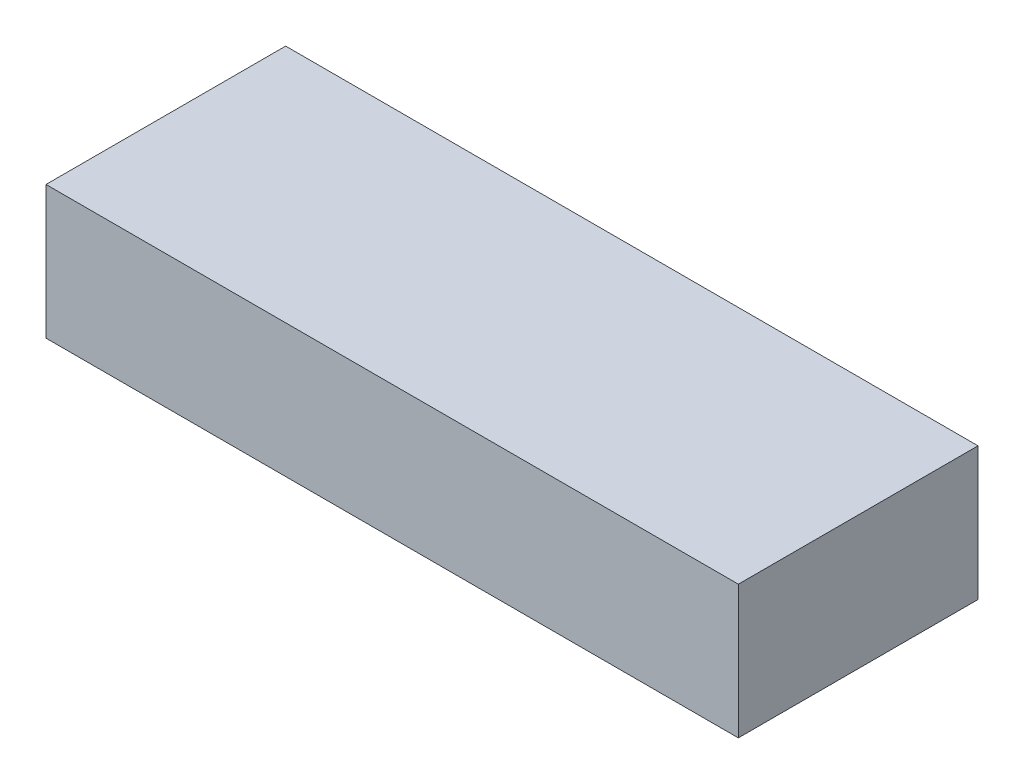
ISO-10303-21;
HEADER;
FILE_DESCRIPTION(('STEP AP214'),'2;1');
FILE_NAME('part.step','',(''),(''),'','','');
FILE_SCHEMA(('AUTOMOTIVE_DESIGN { 1 0 10303 214 1 1 1 1 }'));
ENDSEC;
DATA;
#1=APPLICATION_CONTEXT('core data for automotive mechanical design processes');
#2=APPLICATION_PROTOCOL_DEFINITION('international standard','automotive_design',2000,#1);
#3=PRODUCT_CONTEXT('',#1,'mechanical');
#4=PRODUCT('Part','Part','',(#3));
#5=PRODUCT_RELATED_PRODUCT_CATEGORY('part','',(#4));
#6=PRODUCT_DEFINITION_FORMATION('','',#4);
#7=PRODUCT_DEFINITION_CONTEXT('part definition',#1,'design');
#8=PRODUCT_DEFINITION('design','',#6,#7);
#9=PRODUCT_DEFINITION_SHAPE('','',#8);
#10=(LENGTH_UNIT() NAMED_UNIT(*) SI_UNIT(.MILLI.,.METRE.));
#11=(NAMED_UNIT(*) PLANE_ANGLE_UNIT() SI_UNIT($,.RADIAN.));
#12=(NAMED_UNIT(*) SI_UNIT($,.STERADIAN.) SOLID_ANGLE_UNIT());
#13=UNCERTAINTY_MEASURE_WITH_UNIT(LENGTH_MEASURE(1.E-05),#10,'distance_accuracy_value','');
#14=(GEOMETRIC_REPRESENTATION_CONTEXT(3) GLOBAL_UNCERTAINTY_ASSIGNED_CONTEXT((#13)) GLOBAL_UNIT_ASSIGNED_CONTEXT((#10,
#11,#12)) REPRESENTATION_CONTEXT('',''));
#15=CARTESIAN_POINT('',(0.,0.,0.));
#16=DIRECTION('',(0.,0.,1.));
#17=DIRECTION('',(1.,0.,0.));
#18=AXIS2_PLACEMENT_3D('',#15,#16,#17);
#19=CARTESIAN_POINT('',(-13.,-2.5,9.));
#20=DIRECTION('',(1.,0.,0.));
#21=DIRECTION('',(0.,0.,-1.));
#22=AXIS2_PLACEMENT_3D('',#19,#20,#21);
#23=PLANE('',#22);
#24=DIRECTION('',(0.,-1.,0.));
#25=VECTOR('',#24,1.);
#26=CARTESIAN_POINT('',(-13.,-2.5,0.));
#27=LINE('',#26,#25);
#28=CARTESIAN_POINT('',(-13.,2.5,0.));
#29=VERTEX_POINT('',#28);
#30=CARTESIAN_POINT('',(-13.,-2.5,0.));
#31=VERTEX_POINT('',#30);
#32=EDGE_CURVE('E101',#29,#31,#27,.T.);
#33=ORIENTED_EDGE('',*,*,#32,.T.);
#34=DIRECTION('',(0.,0.,-1.));
#35=VECTOR('',#34,1.);
#36=CARTESIAN_POINT('',(-13.,-2.5,9.));
#37=LINE('',#36,#35);
#38=CARTESIAN_POINT('',(-13.,-2.5,9.));
#39=VERTEX_POINT('',#38);
#40=EDGE_CURVE('E11',#39,#31,#37,.T.);
#41=ORIENTED_EDGE('',*,*,#40,.F.);
#42=DIRECTION('',(0.,-1.,0.));
#43=VECTOR('',#42,1.);
#44=CARTESIAN_POINT('',(-13.,-2.5,9.));
#45=LINE('',#44,#43);
#46=CARTESIAN_POINT('',(-13.,2.5,9.));
#47=VERTEX_POINT('',#46);
#48=EDGE_CURVE('E85',#47,#39,#45,.T.);
#49=ORIENTED_EDGE('',*,*,#48,.F.);
#50=DIRECTION('',(0.,0.,-1.));
#51=VECTOR('',#50,1.);
#52=CARTESIAN_POINT('',(-13.,2.5,9.));
#53=LINE('',#52,#51);
#54=EDGE_CURVE('E97',#47,#29,#53,.T.);
#55=ORIENTED_EDGE('',*,*,#54,.T.);
#56=EDGE_LOOP('',(#33,#41,#49,#55));
#57=FACE_BOUND('',#56,.T.);
#58=ADVANCED_FACE('F34',(#57),#23,.F.);
#59=CARTESIAN_POINT('',(-13.,-2.5,9.));
#60=DIRECTION('',(0.,1.,0.));
#61=DIRECTION('',(-1.,0.,0.));
#62=AXIS2_PLACEMENT_3D('',#59,#60,#61);
#63=PLANE('',#62);
#64=DIRECTION('',(1.,0.,0.));
#65=VECTOR('',#64,1.);
#66=CARTESIAN_POINT('',(-13.,-2.5,0.));
#67=LINE('',#66,#65);
#68=CARTESIAN_POINT('',(13.,-2.5,0.));
#69=VERTEX_POINT('',#68);
#70=EDGE_CURVE('E89',#31,#69,#67,.T.);
#71=ORIENTED_EDGE('',*,*,#70,.T.);
#72=DIRECTION('',(0.,0.,-1.));
#73=VECTOR('',#72,1.);
#74=CARTESIAN_POINT('',(13.,-2.5,9.));
#75=LINE('',#74,#73);
#76=CARTESIAN_POINT('',(13.,-2.5,9.));
#77=VERTEX_POINT('',#76);
#78=EDGE_CURVE('E42',#77,#69,#75,.T.);
#79=ORIENTED_EDGE('',*,*,#78,.F.);
#80=DIRECTION('',(1.,0.,0.));
#81=VECTOR('',#80,1.);
#82=CARTESIAN_POINT('',(-13.,-2.5,9.));
#83=LINE('',#82,#81);
#84=EDGE_CURVE('E80',#39,#77,#83,.T.);
#85=ORIENTED_EDGE('',*,*,#84,.F.);
#86=ORIENTED_EDGE('',*,*,#40,.T.);
#87=EDGE_LOOP('',(#71,#79,#85,#86));
#88=FACE_BOUND('',#87,.T.);
#89=ADVANCED_FACE('F88',(#88),#63,.F.);
#90=CARTESIAN_POINT('',(13.,-2.5,9.));
#91=DIRECTION('',(-1.,0.,0.));
#92=DIRECTION('',(0.,0.,1.));
#93=AXIS2_PLACEMENT_3D('',#90,#91,#92);
#94=PLANE('',#93);
#95=DIRECTION('',(0.,1.,0.));
#96=VECTOR('',#95,1.);
#97=CARTESIAN_POINT('',(13.,-2.5,0.));
#98=LINE('',#97,#96);
#99=CARTESIAN_POINT('',(13.,2.5,0.));
#100=VERTEX_POINT('',#99);
#101=EDGE_CURVE('E67',#69,#100,#98,.T.);
#102=ORIENTED_EDGE('',*,*,#101,.T.);
#103=DIRECTION('',(0.,0.,-1.));
#104=VECTOR('',#103,1.);
#105=CARTESIAN_POINT('',(13.,2.5,9.));
#106=LINE('',#105,#104);
#107=CARTESIAN_POINT('',(13.,2.5,9.));
#108=VERTEX_POINT('',#107);
#109=EDGE_CURVE('E90',#108,#100,#106,.T.);
#110=ORIENTED_EDGE('',*,*,#109,.F.);
#111=DIRECTION('',(0.,1.,0.));
#112=VECTOR('',#111,1.);
#113=CARTESIAN_POINT('',(13.,-2.5,9.));
#114=LINE('',#113,#112);
#115=EDGE_CURVE('E83',#77,#108,#114,.T.);
#116=ORIENTED_EDGE('',*,*,#115,.F.);
#117=ORIENTED_EDGE('',*,*,#78,.T.);
#118=EDGE_LOOP('',(#102,#110,#116,#117));
#119=FACE_BOUND('',#118,.T.);
#120=ADVANCED_FACE('F91',(#119),#94,.F.);
#121=CARTESIAN_POINT('',(-13.,2.5,9.));
#122=DIRECTION('',(0.,-1.,0.));
#123=DIRECTION('',(0.,0.,-1.));
#124=AXIS2_PLACEMENT_3D('',#121,#122,#123);
#125=PLANE('',#124);
#126=DIRECTION('',(-1.,0.,0.));
#127=VECTOR('',#126,1.);
#128=CARTESIAN_POINT('',(-13.,2.5,0.));
#129=LINE('',#128,#127);
#130=EDGE_CURVE('E73',#100,#29,#129,.T.);
#131=ORIENTED_EDGE('',*,*,#130,.T.);
#132=ORIENTED_EDGE('',*,*,#54,.F.);
#133=DIRECTION('',(-1.,0.,0.));
#134=VECTOR('',#133,1.);
#135=CARTESIAN_POINT('',(-13.,2.5,9.));
#136=LINE('',#135,#134);
#137=EDGE_CURVE('E50',#108,#47,#136,.T.);
#138=ORIENTED_EDGE('',*,*,#137,.F.);
#139=ORIENTED_EDGE('',*,*,#109,.T.);
#140=EDGE_LOOP('',(#131,#132,#138,#139));
#141=FACE_BOUND('',#140,.T.);
#142=ADVANCED_FACE('F109',(#141),#125,.F.);
#143=CARTESIAN_POINT('',(-13.,2.5,9.));
#144=DIRECTION('',(0.,0.,-1.));
#145=DIRECTION('',(-1.,0.,0.));
#146=AXIS2_PLACEMENT_3D('',#143,#144,#145);
#147=PLANE('',#146);
#148=ORIENTED_EDGE('',*,*,#48,.T.);
#149=ORIENTED_EDGE('',*,*,#84,.T.);
#150=ORIENTED_EDGE('',*,*,#115,.T.);
#151=ORIENTED_EDGE('',*,*,#137,.T.);
#152=EDGE_LOOP('',(#148,#149,#150,#151));
#153=FACE_BOUND('',#152,.T.);
#154=ADVANCED_FACE('F81',(#153),#147,.F.);
#155=CARTESIAN_POINT('',(-13.,2.5,0.));
#156=DIRECTION('',(0.,0.,-1.));
#157=DIRECTION('',(-1.,0.,0.));
#158=AXIS2_PLACEMENT_3D('',#155,#156,#157);
#159=PLANE('',#158);
#160=ORIENTED_EDGE('',*,*,#32,.F.);
#161=ORIENTED_EDGE('',*,*,#130,.F.);
#162=ORIENTED_EDGE('',*,*,#101,.F.);
#163=ORIENTED_EDGE('',*,*,#70,.F.);
#164=EDGE_LOOP('',(#160,#161,#162,#163));
#165=FACE_BOUND('',#164,.T.);
#166=ADVANCED_FACE('F112',(#165),#159,.T.);
#167=CLOSED_SHELL('',(#58,#89,#120,#142,#154,#166));
#168=MANIFOLD_SOLID_BREP('B2',#167);
#169=ADVANCED_BREP_SHAPE_REPRESENTATION('',(#18,#168),#14);
#170=SHAPE_DEFINITION_REPRESENTATION(#9,#169);
ENDSEC;
END-ISO-10303-21;
